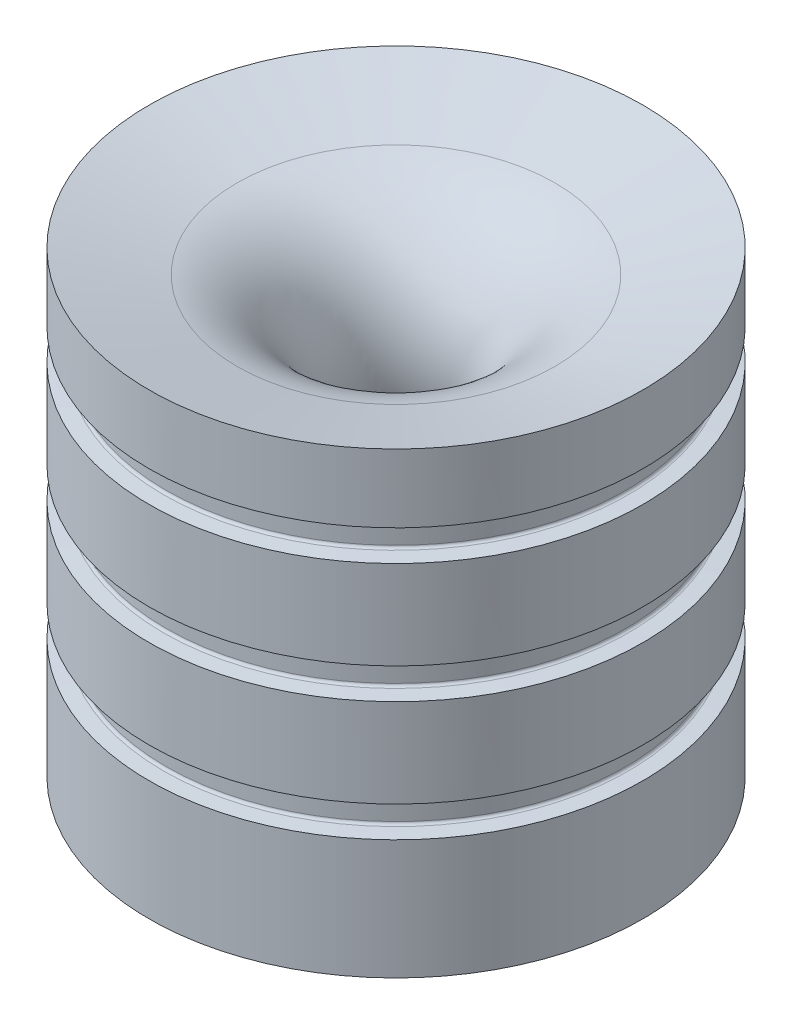
ISO-10303-21;
HEADER;
FILE_DESCRIPTION(('STEP AP214'),'2;1');
FILE_NAME('part.step','',(''),(''),'','','');
FILE_SCHEMA(('AUTOMOTIVE_DESIGN { 1 0 10303 214 1 1 1 1 }'));
ENDSEC;
DATA;
#1=APPLICATION_CONTEXT('core data for automotive mechanical design processes');
#2=APPLICATION_PROTOCOL_DEFINITION('international standard','automotive_design',2000,#1);
#3=PRODUCT_CONTEXT('',#1,'mechanical');
#4=PRODUCT('Part','Part','',(#3));
#5=PRODUCT_RELATED_PRODUCT_CATEGORY('part','',(#4));
#6=PRODUCT_DEFINITION_FORMATION('','',#4);
#7=PRODUCT_DEFINITION_CONTEXT('part definition',#1,'design');
#8=PRODUCT_DEFINITION('design','',#6,#7);
#9=PRODUCT_DEFINITION_SHAPE('','',#8);
#10=(LENGTH_UNIT() NAMED_UNIT(*) SI_UNIT(.MILLI.,.METRE.));
#11=(NAMED_UNIT(*) PLANE_ANGLE_UNIT() SI_UNIT($,.RADIAN.));
#12=(NAMED_UNIT(*) SI_UNIT($,.STERADIAN.) SOLID_ANGLE_UNIT());
#13=UNCERTAINTY_MEASURE_WITH_UNIT(LENGTH_MEASURE(1.E-05),#10,'distance_accuracy_value','');
#14=(GEOMETRIC_REPRESENTATION_CONTEXT(3) GLOBAL_UNCERTAINTY_ASSIGNED_CONTEXT((#13)) GLOBAL_UNIT_ASSIGNED_CONTEXT((#10,
#11,#12)) REPRESENTATION_CONTEXT('',''));
#15=CARTESIAN_POINT('',(0.,0.,0.));
#16=DIRECTION('',(0.,0.,1.));
#17=DIRECTION('',(1.,0.,0.));
#18=AXIS2_PLACEMENT_3D('',#15,#16,#17);
#19=CARTESIAN_POINT('',(0.,11.2038865741592,0.));
#20=DIRECTION('',(0.,-1.,0.));
#21=DIRECTION('',(0.,0.,-1.));
#22=AXIS2_PLACEMENT_3D('',#19,#20,#21);
#23=CYLINDRICAL_SURFACE('',#22,41.275);
#24=CARTESIAN_POINT('',(0.,60.0077777421875,0.));
#25=DIRECTION('',(0.,-1.,0.));
#26=DIRECTION('',(0.,0.,-1.));
#27=AXIS2_PLACEMENT_3D('',#24,#25,#26);
#28=CIRCLE('',#27,41.275);
#29=CARTESIAN_POINT('',(0.,60.0077777421875,-41.275));
#30=VERTEX_POINT('',#29);
#31=EDGE_CURVE('E54',#30,#30,#28,.F.);
#32=ORIENTED_EDGE('',*,*,#31,.F.);
#33=EDGE_LOOP('',(#32));
#34=FACE_BOUND('',#33,.T.);
#35=CARTESIAN_POINT('',(0.,45.1799101451754,0.));
#36=DIRECTION('',(0.,1.,0.));
#37=DIRECTION('',(0.,0.,1.));
#38=AXIS2_PLACEMENT_3D('',#35,#36,#37);
#39=CIRCLE('',#38,41.275);
#40=CARTESIAN_POINT('',(0.,45.1799101451754,41.275));
#41=VERTEX_POINT('',#40);
#42=EDGE_CURVE('E112',#41,#41,#39,.F.);
#43=ORIENTED_EDGE('',*,*,#42,.F.);
#44=EDGE_LOOP('',(#43));
#45=FACE_BOUND('',#44,.T.);
#46=ADVANCED_FACE('F50',(#34,#45),#23,.T.);
#47=CARTESIAN_POINT('',(0.,40.0077777421875,0.));
#48=DIRECTION('',(0.,-1.,0.));
#49=DIRECTION('',(0.,0.,-1.));
#50=AXIS2_PLACEMENT_3D('',#47,#48,#49);
#51=CIRCLE('',#50,41.275);
#52=CARTESIAN_POINT('',(0.,40.0077777421875,-41.275));
#53=VERTEX_POINT('',#52);
#54=EDGE_CURVE('E563',#53,#53,#51,.F.);
#55=ORIENTED_EDGE('',*,*,#54,.F.);
#56=EDGE_LOOP('',(#55));
#57=FACE_BOUND('',#56,.T.);
#58=CARTESIAN_POINT('',(0.,25.1799101451754,0.));
#59=DIRECTION('',(0.,1.,0.));
#60=DIRECTION('',(0.,0.,1.));
#61=AXIS2_PLACEMENT_3D('',#58,#59,#60);
#62=CIRCLE('',#61,41.275);
#63=CARTESIAN_POINT('',(0.,25.1799101451754,41.275));
#64=VERTEX_POINT('',#63);
#65=EDGE_CURVE('E69',#64,#64,#62,.F.);
#66=ORIENTED_EDGE('',*,*,#65,.F.);
#67=EDGE_LOOP('',(#66));
#68=FACE_BOUND('',#67,.T.);
#69=ADVANCED_FACE('F469',(#57,#68),#23,.T.);
#70=CARTESIAN_POINT('',(0.,20.0077777421875,0.));
#71=DIRECTION('',(0.,-1.,0.));
#72=DIRECTION('',(0.,0.,-1.));
#73=AXIS2_PLACEMENT_3D('',#70,#71,#72);
#74=CIRCLE('',#73,41.275);
#75=CARTESIAN_POINT('',(0.,20.0077777421875,-41.275));
#76=VERTEX_POINT('',#75);
#77=EDGE_CURVE('E82',#76,#76,#74,.F.);
#78=ORIENTED_EDGE('',*,*,#77,.F.);
#79=EDGE_LOOP('',(#78));
#80=FACE_BOUND('',#79,.T.);
#81=CARTESIAN_POINT('',(0.,0.,0.));
#82=DIRECTION('',(0.,-1.,0.));
#83=DIRECTION('',(0.,0.,-1.));
#84=AXIS2_PLACEMENT_3D('',#81,#82,#83);
#85=CIRCLE('',#84,41.275);
#86=CARTESIAN_POINT('',(0.,0.,-41.275));
#87=VERTEX_POINT('',#86);
#88=EDGE_CURVE('E58',#87,#87,#85,.T.);
#89=ORIENTED_EDGE('',*,*,#88,.F.);
#90=EDGE_LOOP('',(#89));
#91=FACE_BOUND('',#90,.T.);
#92=ADVANCED_FACE('F475',(#80,#91),#23,.T.);
#93=CARTESIAN_POINT('',(0.,76.5907976172275,0.));
#94=DIRECTION('',(0.,1.,0.));
#95=DIRECTION('',(0.,0.,1.));
#96=AXIS2_PLACEMENT_3D('',#93,#94,#95);
#97=CONICAL_SURFACE('',#96,41.275,1.30899693899575);
#98=CARTESIAN_POINT('',(0.,72.6535470946851,0.));
#99=DIRECTION('',(0.,-1.,0.));
#100=DIRECTION('',(0.,0.,-1.));
#101=AXIS2_PLACEMENT_3D('',#98,#99,#100);
#102=CIRCLE('',#101,26.5809810077446);
#103=CARTESIAN_POINT('',(0.,72.6535470946851,-26.5809810077446));
#104=VERTEX_POINT('',#103);
#105=EDGE_CURVE('E76',#104,#104,#102,.T.);
#106=ORIENTED_EDGE('',*,*,#105,.T.);
#107=EDGE_LOOP('',(#106));
#108=FACE_BOUND('',#107,.T.);
#109=CARTESIAN_POINT('',(0.,76.5907976172275,0.));
#110=DIRECTION('',(0.,-1.,0.));
#111=DIRECTION('',(0.,0.,-1.));
#112=AXIS2_PLACEMENT_3D('',#109,#110,#111);
#113=CIRCLE('',#112,41.275);
#114=CARTESIAN_POINT('',(0.,76.5907976172275,-41.275));
#115=VERTEX_POINT('',#114);
#116=EDGE_CURVE('E12',#115,#115,#113,.T.);
#117=ORIENTED_EDGE('',*,*,#116,.F.);
#118=EDGE_LOOP('',(#117));
#119=FACE_BOUND('',#118,.T.);
#120=ADVANCED_FACE('F52',(#108,#119),#97,.F.);
#121=CARTESIAN_POINT('',(0.,65.1799101451754,0.));
#122=DIRECTION('',(0.,1.,0.));
#123=DIRECTION('',(0.,0.,1.));
#124=AXIS2_PLACEMENT_3D('',#121,#122,#123);
#125=CIRCLE('',#124,41.275);
#126=CARTESIAN_POINT('',(0.,65.1799101451754,41.275));
#127=VERTEX_POINT('',#126);
#128=EDGE_CURVE('E132',#127,#127,#125,.F.);
#129=ORIENTED_EDGE('',*,*,#128,.F.);
#130=EDGE_LOOP('',(#129));
#131=FACE_BOUND('',#130,.T.);
#132=ORIENTED_EDGE('',*,*,#116,.T.);
#133=EDGE_LOOP('',(#132));
#134=FACE_BOUND('',#133,.T.);
#135=ADVANCED_FACE('F471',(#131,#134),#23,.T.);
#136=CARTESIAN_POINT('',(41.275,0.,0.));
#137=DIRECTION('',(0.,-1.,0.));
#138=DIRECTION('',(0.,0.,-1.));
#139=AXIS2_PLACEMENT_3D('',#136,#137,#138);
#140=PLANE('',#139);
#141=ORIENTED_EDGE('',*,*,#88,.T.);
#142=EDGE_LOOP('',(#141));
#143=FACE_BOUND('',#142,.T.);
#144=CARTESIAN_POINT('',(0.,0.,0.));
#145=DIRECTION('',(0.,-1.,0.));
#146=DIRECTION('',(0.,0.,-1.));
#147=AXIS2_PLACEMENT_3D('',#144,#145,#146);
#148=CIRCLE('',#147,23.27236431);
#149=CARTESIAN_POINT('',(0.,0.,-23.27236431));
#150=VERTEX_POINT('',#149);
#151=EDGE_CURVE('E63',#150,#150,#148,.T.);
#152=ORIENTED_EDGE('',*,*,#151,.F.);
#153=EDGE_LOOP('',(#152));
#154=FACE_BOUND('',#153,.T.);
#155=ADVANCED_FACE('F481',(#143,#154),#140,.T.);
#156=CARTESIAN_POINT('',(0.,45.7091599240702,0.));
#157=DIRECTION('',(0.,-1.,0.));
#158=DIRECTION('',(0.,0.,-1.));
#159=AXIS2_PLACEMENT_3D('',#156,#157,#158);
#160=CONICAL_SURFACE('',#159,11.0246318216405,0.261799387799147);
#161=ORIENTED_EDGE('',*,*,#151,.T.);
#162=EDGE_LOOP('',(#161));
#163=FACE_BOUND('',#162,.T.);
#164=CARTESIAN_POINT('',(0.,45.7091599240702,0.));
#165=DIRECTION('',(0.,-1.,0.));
#166=DIRECTION('',(0.,0.,-1.));
#167=AXIS2_PLACEMENT_3D('',#164,#165,#166);
#168=CIRCLE('',#167,11.0246318216405);
#169=CARTESIAN_POINT('',(0.,45.7091599240702,-11.0246318216405));
#170=VERTEX_POINT('',#169);
#171=EDGE_CURVE('E81',#170,#170,#168,.T.);
#172=ORIENTED_EDGE('',*,*,#171,.F.);
#173=EDGE_LOOP('',(#172));
#174=FACE_BOUND('',#173,.T.);
#175=ADVANCED_FACE('F487',(#163,#174),#160,.F.);
#176=CARTESIAN_POINT('',(0.,51.4031789163256,0.));
#177=DIRECTION('',(0.,-1.,0.));
#178=DIRECTION('',(0.,0.,-1.));
#179=AXIS2_PLACEMENT_3D('',#176,#177,#178);
#180=TOROIDAL_SURFACE('',#179,32.275,22.);
#181=ORIENTED_EDGE('',*,*,#171,.T.);
#182=EDGE_LOOP('',(#181));
#183=FACE_BOUND('',#182,.T.);
#184=ORIENTED_EDGE('',*,*,#105,.F.);
#185=EDGE_LOOP('',(#184));
#186=FACE_BOUND('',#185,.T.);
#187=ADVANCED_FACE('F505',(#183,#186),#180,.T.);
#188=CARTESIAN_POINT('',(0.,20.6617524869832,0.));
#189=DIRECTION('',(0.,1.,0.));
#190=DIRECTION('',(0.,0.,1.));
#191=AXIS2_PLACEMENT_3D('',#188,#189,#190);
#192=TOROIDAL_SURFACE('',#191,38.9001,0.444499999999995);
#193=CARTESIAN_POINT('',(0.,20.6617524869832,0.));
#194=DIRECTION('',(0.,1.,0.));
#195=DIRECTION('',(0.,0.,1.));
#196=AXIS2_PLACEMENT_3D('',#193,#194,#195);
#197=CIRCLE('',#196,38.4556);
#198=CARTESIAN_POINT('',(0.,20.6617524869832,38.4556));
#199=VERTEX_POINT('',#198);
#200=EDGE_CURVE('E102',#199,#199,#197,.T.);
#201=ORIENTED_EDGE('',*,*,#200,.F.);
#202=EDGE_LOOP('',(#201));
#203=FACE_BOUND('',#202,.T.);
#204=CARTESIAN_POINT('',(0.,20.2189439436814,0.));
#205=DIRECTION('',(0.,1.,0.));
#206=DIRECTION('',(0.,0.,1.));
#207=AXIS2_PLACEMENT_3D('',#204,#205,#206);
#208=CIRCLE('',#207,38.8613592723487);
#209=CARTESIAN_POINT('',(0.,20.2189439436814,38.8613592723487));
#210=VERTEX_POINT('',#209);
#211=EDGE_CURVE('E83',#210,#210,#208,.T.);
#212=ORIENTED_EDGE('',*,*,#211,.T.);
#213=EDGE_LOOP('',(#212));
#214=FACE_BOUND('',#213,.T.);
#215=ADVANCED_FACE('F511',(#203,#214),#192,.F.);
#216=CARTESIAN_POINT('',(0.,20.,0.));
#217=DIRECTION('',(0.,-1.,0.));
#218=DIRECTION('',(0.,0.,-1.));
#219=AXIS2_PLACEMENT_3D('',#216,#217,#218);
#220=CONICAL_SURFACE('',#219,41.3639,1.48352986419518);
#221=ORIENTED_EDGE('',*,*,#77,.T.);
#222=EDGE_LOOP('',(#221));
#223=FACE_BOUND('',#222,.T.);
#224=ORIENTED_EDGE('',*,*,#211,.F.);
#225=EDGE_LOOP('',(#224));
#226=FACE_BOUND('',#225,.T.);
#227=ADVANCED_FACE('F518',(#223,#226),#220,.T.);
#228=CARTESIAN_POINT('',(0.,24.9687439436814,0.));
#229=DIRECTION('',(0.,1.,0.));
#230=DIRECTION('',(0.,0.,1.));
#231=AXIS2_PLACEMENT_3D('',#228,#229,#230);
#232=CONICAL_SURFACE('',#231,38.8613592723487,1.48352986419518);
#233=ORIENTED_EDGE('',*,*,#65,.T.);
#234=EDGE_LOOP('',(#233));
#235=FACE_BOUND('',#234,.T.);
#236=CARTESIAN_POINT('',(0.,24.9687439436814,0.));
#237=DIRECTION('',(0.,1.,0.));
#238=DIRECTION('',(0.,0.,1.));
#239=AXIS2_PLACEMENT_3D('',#236,#237,#238);
#240=CIRCLE('',#239,38.8613592723487);
#241=CARTESIAN_POINT('',(0.,24.9687439436814,38.8613592723487));
#242=VERTEX_POINT('',#241);
#243=EDGE_CURVE('E95',#242,#242,#240,.T.);
#244=ORIENTED_EDGE('',*,*,#243,.T.);
#245=EDGE_LOOP('',(#244));
#246=FACE_BOUND('',#245,.T.);
#247=ADVANCED_FACE('F524',(#235,#246),#232,.T.);
#248=CARTESIAN_POINT('',(0.,24.5259354003796,0.));
#249=DIRECTION('',(0.,1.,0.));
#250=DIRECTION('',(0.,0.,1.));
#251=AXIS2_PLACEMENT_3D('',#248,#249,#250);
#252=TOROIDAL_SURFACE('',#251,38.9001,0.4445);
#253=ORIENTED_EDGE('',*,*,#243,.F.);
#254=EDGE_LOOP('',(#253));
#255=FACE_BOUND('',#254,.T.);
#256=CARTESIAN_POINT('',(0.,24.5259354003796,0.));
#257=DIRECTION('',(0.,1.,0.));
#258=DIRECTION('',(0.,0.,1.));
#259=AXIS2_PLACEMENT_3D('',#256,#257,#258);
#260=CIRCLE('',#259,38.4556);
#261=CARTESIAN_POINT('',(0.,24.5259354003796,38.4556));
#262=VERTEX_POINT('',#261);
#263=EDGE_CURVE('E99',#262,#262,#260,.T.);
#264=ORIENTED_EDGE('',*,*,#263,.T.);
#265=EDGE_LOOP('',(#264));
#266=FACE_BOUND('',#265,.T.);
#267=ADVANCED_FACE('F528',(#255,#266),#252,.F.);
#268=CARTESIAN_POINT('',(0.,-38.7961134258408,0.));
#269=DIRECTION('',(0.,1.,0.));
#270=DIRECTION('',(0.,0.,1.));
#271=AXIS2_PLACEMENT_3D('',#268,#269,#270);
#272=CYLINDRICAL_SURFACE('',#271,38.4556);
#273=ORIENTED_EDGE('',*,*,#263,.F.);
#274=EDGE_LOOP('',(#273));
#275=FACE_BOUND('',#274,.T.);
#276=ORIENTED_EDGE('',*,*,#200,.T.);
#277=EDGE_LOOP('',(#276));
#278=FACE_BOUND('',#277,.T.);
#279=ADVANCED_FACE('F532',(#275,#278),#272,.T.);
#280=CARTESIAN_POINT('',(0.,40.6617524869832,0.));
#281=DIRECTION('',(0.,1.,0.));
#282=DIRECTION('',(0.,0.,1.));
#283=AXIS2_PLACEMENT_3D('',#280,#281,#282);
#284=TOROIDAL_SURFACE('',#283,38.9001,0.444499999999995);
#285=CARTESIAN_POINT('',(0.,40.6617524869832,0.));
#286=DIRECTION('',(0.,1.,0.));
#287=DIRECTION('',(0.,0.,1.));
#288=AXIS2_PLACEMENT_3D('',#285,#286,#287);
#289=CIRCLE('',#288,38.4556);
#290=CARTESIAN_POINT('',(0.,40.6617524869832,38.4556));
#291=VERTEX_POINT('',#290);
#292=EDGE_CURVE('E121',#291,#291,#289,.T.);
#293=ORIENTED_EDGE('',*,*,#292,.F.);
#294=EDGE_LOOP('',(#293));
#295=FACE_BOUND('',#294,.T.);
#296=CARTESIAN_POINT('',(0.,40.2189439436814,0.));
#297=DIRECTION('',(0.,1.,0.));
#298=DIRECTION('',(0.,0.,1.));
#299=AXIS2_PLACEMENT_3D('',#296,#297,#298);
#300=CIRCLE('',#299,38.8613592723487);
#301=CARTESIAN_POINT('',(0.,40.2189439436814,38.8613592723487));
#302=VERTEX_POINT('',#301);
#303=EDGE_CURVE('E109',#302,#302,#300,.T.);
#304=ORIENTED_EDGE('',*,*,#303,.T.);
#305=EDGE_LOOP('',(#304));
#306=FACE_BOUND('',#305,.T.);
#307=ADVANCED_FACE('F536',(#295,#306),#284,.F.);
#308=CARTESIAN_POINT('',(0.,40.,0.));
#309=DIRECTION('',(0.,-1.,0.));
#310=DIRECTION('',(0.,0.,-1.));
#311=AXIS2_PLACEMENT_3D('',#308,#309,#310);
#312=CONICAL_SURFACE('',#311,41.3639,1.48352986419518);
#313=ORIENTED_EDGE('',*,*,#54,.T.);
#314=EDGE_LOOP('',(#313));
#315=FACE_BOUND('',#314,.T.);
#316=ORIENTED_EDGE('',*,*,#303,.F.);
#317=EDGE_LOOP('',(#316));
#318=FACE_BOUND('',#317,.T.);
#319=ADVANCED_FACE('F540',(#315,#318),#312,.T.);
#320=CARTESIAN_POINT('',(0.,44.9687439436814,0.));
#321=DIRECTION('',(0.,1.,0.));
#322=DIRECTION('',(0.,0.,1.));
#323=AXIS2_PLACEMENT_3D('',#320,#321,#322);
#324=CONICAL_SURFACE('',#323,38.8613592723487,1.48352986419518);
#325=ORIENTED_EDGE('',*,*,#42,.T.);
#326=EDGE_LOOP('',(#325));
#327=FACE_BOUND('',#326,.T.);
#328=CARTESIAN_POINT('',(0.,44.9687439436814,0.));
#329=DIRECTION('',(0.,1.,0.));
#330=DIRECTION('',(0.,0.,1.));
#331=AXIS2_PLACEMENT_3D('',#328,#329,#330);
#332=CIRCLE('',#331,38.8613592723487);
#333=CARTESIAN_POINT('',(0.,44.9687439436814,38.8613592723487));
#334=VERTEX_POINT('',#333);
#335=EDGE_CURVE('E113',#334,#334,#332,.T.);
#336=ORIENTED_EDGE('',*,*,#335,.T.);
#337=EDGE_LOOP('',(#336));
#338=FACE_BOUND('',#337,.T.);
#339=ADVANCED_FACE('F544',(#327,#338),#324,.T.);
#340=CARTESIAN_POINT('',(0.,44.5259354003796,0.));
#341=DIRECTION('',(0.,1.,0.));
#342=DIRECTION('',(0.,0.,1.));
#343=AXIS2_PLACEMENT_3D('',#340,#341,#342);
#344=TOROIDAL_SURFACE('',#343,38.9001,0.4445);
#345=ORIENTED_EDGE('',*,*,#335,.F.);
#346=EDGE_LOOP('',(#345));
#347=FACE_BOUND('',#346,.T.);
#348=CARTESIAN_POINT('',(0.,44.5259354003796,0.));
#349=DIRECTION('',(0.,1.,0.));
#350=DIRECTION('',(0.,0.,1.));
#351=AXIS2_PLACEMENT_3D('',#348,#349,#350);
#352=CIRCLE('',#351,38.4556);
#353=CARTESIAN_POINT('',(0.,44.5259354003796,38.4556));
#354=VERTEX_POINT('',#353);
#355=EDGE_CURVE('E117',#354,#354,#352,.T.);
#356=ORIENTED_EDGE('',*,*,#355,.T.);
#357=EDGE_LOOP('',(#356));
#358=FACE_BOUND('',#357,.T.);
#359=ADVANCED_FACE('F548',(#347,#358),#344,.F.);
#360=CARTESIAN_POINT('',(0.,-18.7961134258408,0.));
#361=DIRECTION('',(0.,1.,0.));
#362=DIRECTION('',(0.,0.,1.));
#363=AXIS2_PLACEMENT_3D('',#360,#361,#362);
#364=CYLINDRICAL_SURFACE('',#363,38.4556);
#365=ORIENTED_EDGE('',*,*,#355,.F.);
#366=EDGE_LOOP('',(#365));
#367=FACE_BOUND('',#366,.T.);
#368=ORIENTED_EDGE('',*,*,#292,.T.);
#369=EDGE_LOOP('',(#368));
#370=FACE_BOUND('',#369,.T.);
#371=ADVANCED_FACE('F453',(#367,#370),#364,.T.);
#372=CARTESIAN_POINT('',(0.,60.6617524869832,0.));
#373=DIRECTION('',(0.,1.,0.));
#374=DIRECTION('',(0.,0.,1.));
#375=AXIS2_PLACEMENT_3D('',#372,#373,#374);
#376=TOROIDAL_SURFACE('',#375,38.9001,0.444499999999995);
#377=CARTESIAN_POINT('',(0.,60.6617524869832,0.));
#378=DIRECTION('',(0.,1.,0.));
#379=DIRECTION('',(0.,0.,1.));
#380=AXIS2_PLACEMENT_3D('',#377,#378,#379);
#381=CIRCLE('',#380,38.4556);
#382=CARTESIAN_POINT('',(0.,60.6617524869832,38.4556));
#383=VERTEX_POINT('',#382);
#384=EDGE_CURVE('E141',#383,#383,#381,.T.);
#385=ORIENTED_EDGE('',*,*,#384,.F.);
#386=EDGE_LOOP('',(#385));
#387=FACE_BOUND('',#386,.T.);
#388=CARTESIAN_POINT('',(0.,60.2189439436814,0.));
#389=DIRECTION('',(0.,1.,0.));
#390=DIRECTION('',(0.,0.,1.));
#391=AXIS2_PLACEMENT_3D('',#388,#389,#390);
#392=CIRCLE('',#391,38.8613592723487);
#393=CARTESIAN_POINT('',(0.,60.2189439436814,38.8613592723487));
#394=VERTEX_POINT('',#393);
#395=EDGE_CURVE('E129',#394,#394,#392,.T.);
#396=ORIENTED_EDGE('',*,*,#395,.T.);
#397=EDGE_LOOP('',(#396));
#398=FACE_BOUND('',#397,.T.);
#399=ADVANCED_FACE('F449',(#387,#398),#376,.F.);
#400=CARTESIAN_POINT('',(0.,60.,0.));
#401=DIRECTION('',(0.,-1.,0.));
#402=DIRECTION('',(0.,0.,-1.));
#403=AXIS2_PLACEMENT_3D('',#400,#401,#402);
#404=CONICAL_SURFACE('',#403,41.3639,1.48352986419518);
#405=ORIENTED_EDGE('',*,*,#31,.T.);
#406=EDGE_LOOP('',(#405));
#407=FACE_BOUND('',#406,.T.);
#408=ORIENTED_EDGE('',*,*,#395,.F.);
#409=EDGE_LOOP('',(#408));
#410=FACE_BOUND('',#409,.T.);
#411=ADVANCED_FACE('F452',(#407,#410),#404,.T.);
#412=CARTESIAN_POINT('',(0.,64.9687439436814,0.));
#413=DIRECTION('',(0.,1.,0.));
#414=DIRECTION('',(0.,0.,1.));
#415=AXIS2_PLACEMENT_3D('',#412,#413,#414);
#416=CONICAL_SURFACE('',#415,38.8613592723487,1.48352986419518);
#417=ORIENTED_EDGE('',*,*,#128,.T.);
#418=EDGE_LOOP('',(#417));
#419=FACE_BOUND('',#418,.T.);
#420=CARTESIAN_POINT('',(0.,64.9687439436814,0.));
#421=DIRECTION('',(0.,1.,0.));
#422=DIRECTION('',(0.,0.,1.));
#423=AXIS2_PLACEMENT_3D('',#420,#421,#422);
#424=CIRCLE('',#423,38.8613592723487);
#425=CARTESIAN_POINT('',(0.,64.9687439436814,38.8613592723487));
#426=VERTEX_POINT('',#425);
#427=EDGE_CURVE('E133',#426,#426,#424,.T.);
#428=ORIENTED_EDGE('',*,*,#427,.T.);
#429=EDGE_LOOP('',(#428));
#430=FACE_BOUND('',#429,.T.);
#431=ADVANCED_FACE('F458',(#419,#430),#416,.T.);
#432=CARTESIAN_POINT('',(0.,64.5259354003796,0.));
#433=DIRECTION('',(0.,1.,0.));
#434=DIRECTION('',(0.,0.,1.));
#435=AXIS2_PLACEMENT_3D('',#432,#433,#434);
#436=TOROIDAL_SURFACE('',#435,38.9001,0.4445);
#437=ORIENTED_EDGE('',*,*,#427,.F.);
#438=EDGE_LOOP('',(#437));
#439=FACE_BOUND('',#438,.T.);
#440=CARTESIAN_POINT('',(0.,64.5259354003796,0.));
#441=DIRECTION('',(0.,1.,0.));
#442=DIRECTION('',(0.,0.,1.));
#443=AXIS2_PLACEMENT_3D('',#440,#441,#442);
#444=CIRCLE('',#443,38.4556);
#445=CARTESIAN_POINT('',(0.,64.5259354003796,38.4556));
#446=VERTEX_POINT('',#445);
#447=EDGE_CURVE('E137',#446,#446,#444,.T.);
#448=ORIENTED_EDGE('',*,*,#447,.T.);
#449=EDGE_LOOP('',(#448));
#450=FACE_BOUND('',#449,.T.);
#451=ADVANCED_FACE('F464',(#439,#450),#436,.F.);
#452=CARTESIAN_POINT('',(0.,1.20388657415923,0.));
#453=DIRECTION('',(0.,1.,0.));
#454=DIRECTION('',(0.,0.,1.));
#455=AXIS2_PLACEMENT_3D('',#452,#453,#454);
#456=CYLINDRICAL_SURFACE('',#455,38.4556);
#457=ORIENTED_EDGE('',*,*,#447,.F.);
#458=EDGE_LOOP('',(#457));
#459=FACE_BOUND('',#458,.T.);
#460=ORIENTED_EDGE('',*,*,#384,.T.);
#461=EDGE_LOOP('',(#460));
#462=FACE_BOUND('',#461,.T.);
#463=ADVANCED_FACE('F447',(#459,#462),#456,.T.);
#464=CLOSED_SHELL('',(#46,#69,#92,#120,#135,#155,#175,#187,#215,#227,#247,#267,#279,#307,#319,
#339,#359,#371,#399,#411,#431,#451,#463));
#465=MANIFOLD_SOLID_BREP('B2',#464);
#466=ADVANCED_BREP_SHAPE_REPRESENTATION('',(#18,#465),#14);
#467=SHAPE_DEFINITION_REPRESENTATION(#9,#466);
ENDSEC;
END-ISO-10303-21;
